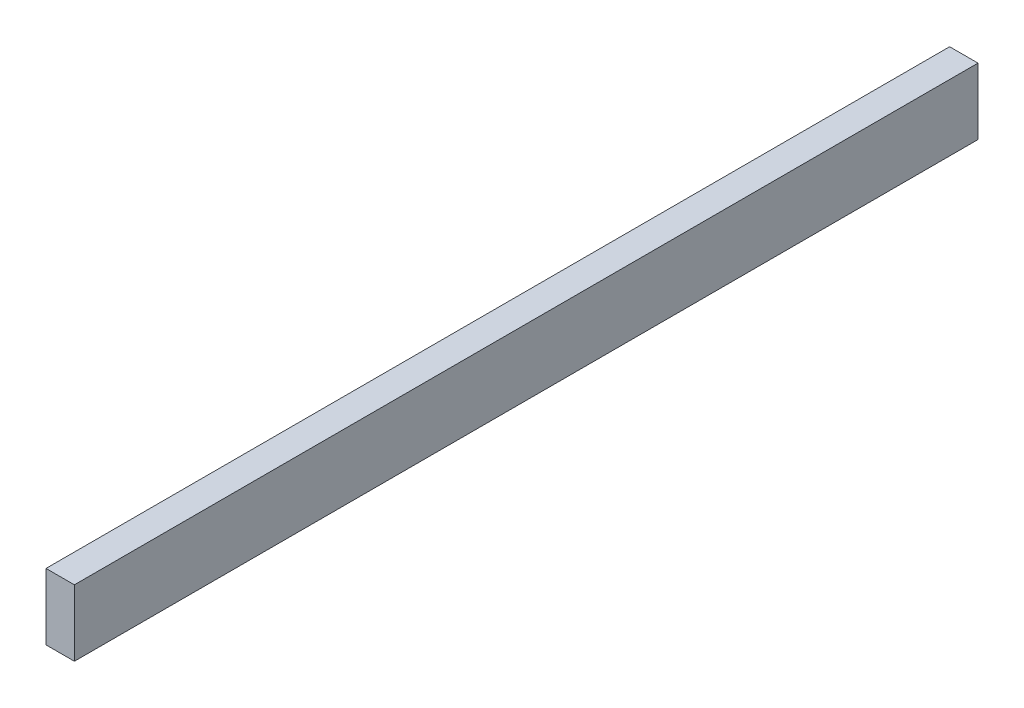
ISO-10303-21;
HEADER;
FILE_DESCRIPTION(('STEP AP214'),'2;1');
FILE_NAME('part.step','',(''),(''),'','','');
FILE_SCHEMA(('AUTOMOTIVE_DESIGN { 1 0 10303 214 1 1 1 1 }'));
ENDSEC;
DATA;
#1=APPLICATION_CONTEXT('core data for automotive mechanical design processes');
#2=APPLICATION_PROTOCOL_DEFINITION('international standard','automotive_design',2000,#1);
#3=PRODUCT_CONTEXT('',#1,'mechanical');
#4=PRODUCT('Part','Part','',(#3));
#5=PRODUCT_RELATED_PRODUCT_CATEGORY('part','',(#4));
#6=PRODUCT_DEFINITION_FORMATION('','',#4);
#7=PRODUCT_DEFINITION_CONTEXT('part definition',#1,'design');
#8=PRODUCT_DEFINITION('design','',#6,#7);
#9=PRODUCT_DEFINITION_SHAPE('','',#8);
#10=(LENGTH_UNIT() NAMED_UNIT(*) SI_UNIT(.MILLI.,.METRE.));
#11=(NAMED_UNIT(*) PLANE_ANGLE_UNIT() SI_UNIT($,.RADIAN.));
#12=(NAMED_UNIT(*) SI_UNIT($,.STERADIAN.) SOLID_ANGLE_UNIT());
#13=UNCERTAINTY_MEASURE_WITH_UNIT(LENGTH_MEASURE(1.E-05),#10,'distance_accuracy_value','');
#14=(GEOMETRIC_REPRESENTATION_CONTEXT(3) GLOBAL_UNCERTAINTY_ASSIGNED_CONTEXT((#13)) GLOBAL_UNIT_ASSIGNED_CONTEXT((#10,
#11,#12)) REPRESENTATION_CONTEXT('',''));
#15=CARTESIAN_POINT('',(0.,0.,0.));
#16=DIRECTION('',(0.,0.,1.));
#17=DIRECTION('',(1.,0.,0.));
#18=AXIS2_PLACEMENT_3D('',#15,#16,#17);
#19=CARTESIAN_POINT('',(-16.9556263858387,37.5347127791179,1212.85));
#20=DIRECTION('',(1.,0.,0.));
#21=DIRECTION('',(0.,1.,0.));
#22=AXIS2_PLACEMENT_3D('',#19,#20,#21);
#23=PLANE('',#22);
#24=DIRECTION('',(0.,-1.,0.));
#25=VECTOR('',#24,1.);
#26=CARTESIAN_POINT('',(-16.9556263858387,37.5347127791179,0.));
#27=LINE('',#26,#25);
#28=CARTESIAN_POINT('',(-16.9556263858387,37.5347127791179,0.));
#29=VERTEX_POINT('',#28);
#30=CARTESIAN_POINT('',(-16.9556263858387,-51.3652872208821,0.));
#31=VERTEX_POINT('',#30);
#32=EDGE_CURVE('E95',#29,#31,#27,.T.);
#33=ORIENTED_EDGE('',*,*,#32,.T.);
#34=DIRECTION('',(0.,0.,-1.));
#35=VECTOR('',#34,1.);
#36=CARTESIAN_POINT('',(-16.9556263858387,-51.3652872208821,1212.85));
#37=LINE('',#36,#35);
#38=CARTESIAN_POINT('',(-16.9556263858387,-51.3652872208821,1212.85));
#39=VERTEX_POINT('',#38);
#40=EDGE_CURVE('E11',#39,#31,#37,.T.);
#41=ORIENTED_EDGE('',*,*,#40,.F.);
#42=DIRECTION('',(0.,-1.,0.));
#43=VECTOR('',#42,1.);
#44=CARTESIAN_POINT('',(-16.9556263858387,37.5347127791179,1212.85));
#45=LINE('',#44,#43);
#46=CARTESIAN_POINT('',(-16.9556263858387,37.5347127791179,1212.85));
#47=VERTEX_POINT('',#46);
#48=EDGE_CURVE('E83',#47,#39,#45,.T.);
#49=ORIENTED_EDGE('',*,*,#48,.F.);
#50=DIRECTION('',(0.,0.,-1.));
#51=VECTOR('',#50,1.);
#52=CARTESIAN_POINT('',(-16.9556263858387,37.5347127791179,1212.85));
#53=LINE('',#52,#51);
#54=EDGE_CURVE('E91',#47,#29,#53,.T.);
#55=ORIENTED_EDGE('',*,*,#54,.T.);
#56=EDGE_LOOP('',(#33,#41,#49,#55));
#57=FACE_BOUND('',#56,.T.);
#58=ADVANCED_FACE('F32',(#57),#23,.F.);
#59=CARTESIAN_POINT('',(-16.9556263858387,-51.3652872208821,1212.85));
#60=DIRECTION('',(0.,1.,0.));
#61=DIRECTION('',(0.,0.,1.));
#62=AXIS2_PLACEMENT_3D('',#59,#60,#61);
#63=PLANE('',#62);
#64=DIRECTION('',(1.,0.,0.));
#65=VECTOR('',#64,1.);
#66=CARTESIAN_POINT('',(-16.9556263858387,-51.3652872208821,0.));
#67=LINE('',#66,#65);
#68=CARTESIAN_POINT('',(21.1443736141613,-51.3652872208821,0.));
#69=VERTEX_POINT('',#68);
#70=EDGE_CURVE('E87',#31,#69,#67,.T.);
#71=ORIENTED_EDGE('',*,*,#70,.T.);
#72=DIRECTION('',(0.,0.,-1.));
#73=VECTOR('',#72,1.);
#74=CARTESIAN_POINT('',(21.1443736141613,-51.3652872208821,1212.85));
#75=LINE('',#74,#73);
#76=CARTESIAN_POINT('',(21.1443736141613,-51.3652872208821,1212.85));
#77=VERTEX_POINT('',#76);
#78=EDGE_CURVE('E40',#77,#69,#75,.T.);
#79=ORIENTED_EDGE('',*,*,#78,.F.);
#80=DIRECTION('',(1.,0.,0.));
#81=VECTOR('',#80,1.);
#82=CARTESIAN_POINT('',(-16.9556263858387,-51.3652872208821,1212.85));
#83=LINE('',#82,#81);
#84=EDGE_CURVE('E78',#39,#77,#83,.T.);
#85=ORIENTED_EDGE('',*,*,#84,.F.);
#86=ORIENTED_EDGE('',*,*,#40,.T.);
#87=EDGE_LOOP('',(#71,#79,#85,#86));
#88=FACE_BOUND('',#87,.T.);
#89=ADVANCED_FACE('F86',(#88),#63,.F.);
#90=CARTESIAN_POINT('',(21.1443736141613,37.5347127791179,1212.85));
#91=DIRECTION('',(-1.,0.,0.));
#92=DIRECTION('',(0.,-1.,0.));
#93=AXIS2_PLACEMENT_3D('',#90,#91,#92);
#94=PLANE('',#93);
#95=DIRECTION('',(0.,1.,0.));
#96=VECTOR('',#95,1.);
#97=CARTESIAN_POINT('',(21.1443736141613,37.5347127791179,0.));
#98=LINE('',#97,#96);
#99=CARTESIAN_POINT('',(21.1443736141613,37.5347127791179,0.));
#100=VERTEX_POINT('',#99);
#101=EDGE_CURVE('E65',#69,#100,#98,.T.);
#102=ORIENTED_EDGE('',*,*,#101,.T.);
#103=DIRECTION('',(0.,0.,-1.));
#104=VECTOR('',#103,1.);
#105=CARTESIAN_POINT('',(21.1443736141613,37.5347127791179,1212.85));
#106=LINE('',#105,#104);
#107=CARTESIAN_POINT('',(21.1443736141613,37.5347127791179,1212.85));
#108=VERTEX_POINT('',#107);
#109=EDGE_CURVE('E88',#108,#100,#106,.T.);
#110=ORIENTED_EDGE('',*,*,#109,.F.);
#111=DIRECTION('',(0.,1.,0.));
#112=VECTOR('',#111,1.);
#113=CARTESIAN_POINT('',(21.1443736141613,37.5347127791179,1212.85));
#114=LINE('',#113,#112);
#115=EDGE_CURVE('E81',#77,#108,#114,.T.);
#116=ORIENTED_EDGE('',*,*,#115,.F.);
#117=ORIENTED_EDGE('',*,*,#78,.T.);
#118=EDGE_LOOP('',(#102,#110,#116,#117));
#119=FACE_BOUND('',#118,.T.);
#120=ADVANCED_FACE('F89',(#119),#94,.F.);
#121=CARTESIAN_POINT('',(-16.9556263858387,37.5347127791179,1212.85));
#122=DIRECTION('',(0.,-1.,0.));
#123=DIRECTION('',(0.,0.,-1.));
#124=AXIS2_PLACEMENT_3D('',#121,#122,#123);
#125=PLANE('',#124);
#126=DIRECTION('',(-1.,0.,0.));
#127=VECTOR('',#126,1.);
#128=CARTESIAN_POINT('',(-16.9556263858387,37.5347127791179,0.));
#129=LINE('',#128,#127);
#130=EDGE_CURVE('E71',#100,#29,#129,.T.);
#131=ORIENTED_EDGE('',*,*,#130,.T.);
#132=ORIENTED_EDGE('',*,*,#54,.F.);
#133=DIRECTION('',(-1.,0.,0.));
#134=VECTOR('',#133,1.);
#135=CARTESIAN_POINT('',(-16.9556263858387,37.5347127791179,1212.85));
#136=LINE('',#135,#134);
#137=EDGE_CURVE('E48',#108,#47,#136,.T.);
#138=ORIENTED_EDGE('',*,*,#137,.F.);
#139=ORIENTED_EDGE('',*,*,#109,.T.);
#140=EDGE_LOOP('',(#131,#132,#138,#139));
#141=FACE_BOUND('',#140,.T.);
#142=ADVANCED_FACE('F102',(#141),#125,.F.);
#143=CARTESIAN_POINT('',(0.,0.,1212.85));
#144=DIRECTION('',(0.,0.,1.));
#145=DIRECTION('',(1.,0.,0.));
#146=AXIS2_PLACEMENT_3D('',#143,#144,#145);
#147=PLANE('',#146);
#148=ORIENTED_EDGE('',*,*,#48,.T.);
#149=ORIENTED_EDGE('',*,*,#84,.T.);
#150=ORIENTED_EDGE('',*,*,#115,.T.);
#151=ORIENTED_EDGE('',*,*,#137,.T.);
#152=EDGE_LOOP('',(#148,#149,#150,#151));
#153=FACE_BOUND('',#152,.T.);
#154=ADVANCED_FACE('F79',(#153),#147,.T.);
#155=CARTESIAN_POINT('',(0.,0.,0.));
#156=DIRECTION('',(0.,0.,1.));
#157=DIRECTION('',(1.,0.,0.));
#158=AXIS2_PLACEMENT_3D('',#155,#156,#157);
#159=PLANE('',#158);
#160=ORIENTED_EDGE('',*,*,#32,.F.);
#161=ORIENTED_EDGE('',*,*,#130,.F.);
#162=ORIENTED_EDGE('',*,*,#101,.F.);
#163=ORIENTED_EDGE('',*,*,#70,.F.);
#164=EDGE_LOOP('',(#160,#161,#162,#163));
#165=FACE_BOUND('',#164,.T.);
#166=ADVANCED_FACE('F105',(#165),#159,.F.);
#167=CLOSED_SHELL('',(#58,#89,#120,#142,#154,#166));
#168=MANIFOLD_SOLID_BREP('B2',#167);
#169=ADVANCED_BREP_SHAPE_REPRESENTATION('',(#18,#168),#14);
#170=SHAPE_DEFINITION_REPRESENTATION(#9,#169);
ENDSEC;
END-ISO-10303-21;
